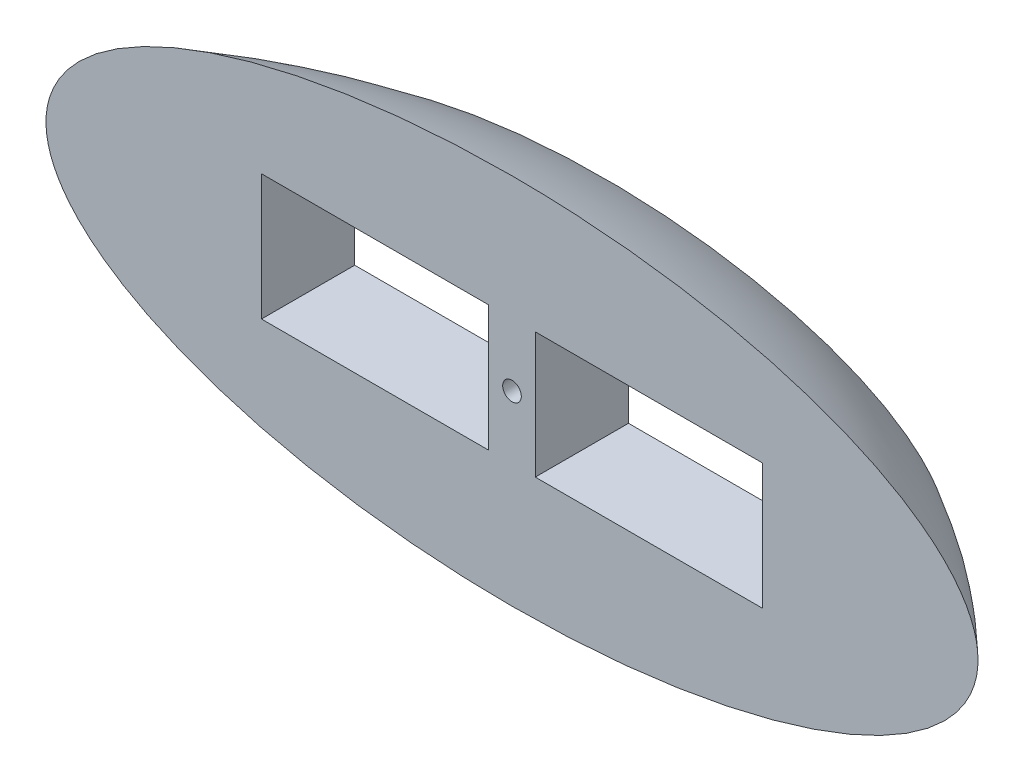
ISO-10303-21;
HEADER;
FILE_DESCRIPTION(('STEP AP214'),'2;1');
FILE_NAME('part.step','',(''),(''),'','','');
FILE_SCHEMA(('AUTOMOTIVE_DESIGN { 1 0 10303 214 1 1 1 1 }'));
ENDSEC;
DATA;
#1=APPLICATION_CONTEXT('core data for automotive mechanical design processes');
#2=APPLICATION_PROTOCOL_DEFINITION('international standard','automotive_design',2000,#1);
#3=PRODUCT_CONTEXT('',#1,'mechanical');
#4=PRODUCT('Part','Part','',(#3));
#5=PRODUCT_RELATED_PRODUCT_CATEGORY('part','',(#4));
#6=PRODUCT_DEFINITION_FORMATION('','',#4);
#7=PRODUCT_DEFINITION_CONTEXT('part definition',#1,'design');
#8=PRODUCT_DEFINITION('design','',#6,#7);
#9=PRODUCT_DEFINITION_SHAPE('','',#8);
#10=(LENGTH_UNIT() NAMED_UNIT(*) SI_UNIT(.MILLI.,.METRE.));
#11=(NAMED_UNIT(*) PLANE_ANGLE_UNIT() SI_UNIT($,.RADIAN.));
#12=(NAMED_UNIT(*) SI_UNIT($,.STERADIAN.) SOLID_ANGLE_UNIT());
#13=UNCERTAINTY_MEASURE_WITH_UNIT(LENGTH_MEASURE(1.E-05),#10,'distance_accuracy_value','');
#14=(GEOMETRIC_REPRESENTATION_CONTEXT(3) GLOBAL_UNCERTAINTY_ASSIGNED_CONTEXT((#13)) GLOBAL_UNIT_ASSIGNED_CONTEXT((#10,
#11,#12)) REPRESENTATION_CONTEXT('',''));
#15=CARTESIAN_POINT('',(0.,0.,0.));
#16=DIRECTION('',(0.,0.,1.));
#17=DIRECTION('',(1.,0.,0.));
#18=AXIS2_PLACEMENT_3D('',#15,#16,#17);
#19=CARTESIAN_POINT('',(0.,0.,50.8));
#20=DIRECTION('',(0.,0.,-1.));
#21=DIRECTION('',(-1.,0.,0.));
#22=AXIS2_PLACEMENT_3D('',#19,#20,#21);
#23=CYLINDRICAL_SURFACE('',#22,5.08);
#24=CARTESIAN_POINT('',(0.,0.,0.));
#25=DIRECTION('',(0.,0.,1.));
#26=DIRECTION('',(1.,0.,0.));
#27=AXIS2_PLACEMENT_3D('',#24,#25,#26);
#28=CIRCLE('',#27,5.08);
#29=CARTESIAN_POINT('',(5.08,0.,0.));
#30=VERTEX_POINT('',#29);
#31=EDGE_CURVE('E130',#30,#30,#28,.T.);
#32=ORIENTED_EDGE('',*,*,#31,.T.);
#33=EDGE_LOOP('',(#32));
#34=FACE_BOUND('',#33,.T.);
#35=CARTESIAN_POINT('',(0.,0.,-50.8));
#36=DIRECTION('',(0.,0.,1.));
#37=DIRECTION('',(1.,0.,0.));
#38=AXIS2_PLACEMENT_3D('',#35,#36,#37);
#39=CIRCLE('',#38,5.08);
#40=CARTESIAN_POINT('',(5.08,0.,-50.8));
#41=VERTEX_POINT('',#40);
#42=EDGE_CURVE('E47',#41,#41,#39,.T.);
#43=ORIENTED_EDGE('',*,*,#42,.F.);
#44=EDGE_LOOP('',(#43));
#45=FACE_BOUND('',#44,.T.);
#46=ADVANCED_FACE('F40',(#34,#45),#23,.F.);
#47=CARTESIAN_POINT('',(0.,0.,0.));
#48=DIRECTION('',(0.,0.,1.));
#49=DIRECTION('',(1.,0.,0.));
#50=AXIS2_PLACEMENT_3D('',#47,#48,#49);
#51=PLANE('',#50);
#52=CARTESIAN_POINT('',(0.,-101.6,0.));
#53=CARTESIAN_POINT('',(508.,-101.6,0.));
#54=CARTESIAN_POINT('',(508.,101.6,0.));
#55=CARTESIAN_POINT('',(0.,101.6,0.));
#56=CARTESIAN_POINT('',(-508.,101.6,0.));
#57=CARTESIAN_POINT('',(-508.,-101.6,0.));
#58=CARTESIAN_POINT('',(0.,-101.6,0.));
#59=(BOUNDED_CURVE() B_SPLINE_CURVE(3,(#52,#53,#54,#55,#56,#57,#58),.UNSPECIFIED.,.T.,
.F.) B_SPLINE_CURVE_WITH_KNOTS((4,3,4),(0.,0.5,1.),
.UNSPECIFIED.) CURVE() GEOMETRIC_REPRESENTATION_ITEM() RATIONAL_B_SPLINE_CURVE((1.,
0.333333333333333,0.333333333333333,1.,0.333333333333333,0.333333333333333,1.)) REPRESENTATION_ITEM(''));
#60=CARTESIAN_POINT('',(254.,0.,0.));
#61=VERTEX_POINT('',#60);
#62=CARTESIAN_POINT('',(0.,101.6,0.));
#63=VERTEX_POINT('',#62);
#64=EDGE_CURVE('E58',#61,#63,#59,.F.);
#65=ORIENTED_EDGE('',*,*,#64,.F.);
#66=CARTESIAN_POINT('',(254.,0.,0.));
#67=CARTESIAN_POINT('',(254.,203.2,0.));
#68=CARTESIAN_POINT('',(-254.,203.2,0.));
#69=CARTESIAN_POINT('',(-254.,0.,0.));
#70=CARTESIAN_POINT('',(-254.,-203.2,0.));
#71=CARTESIAN_POINT('',(254.,-203.2,0.));
#72=CARTESIAN_POINT('',(254.,0.,0.));
#73=(BOUNDED_CURVE() B_SPLINE_CURVE(3,(#66,#67,#68,#69,#70,#71,#72),.UNSPECIFIED.,.T.,
.F.) B_SPLINE_CURVE_WITH_KNOTS((4,3,4),(0.,0.5,1.),
.UNSPECIFIED.) CURVE() GEOMETRIC_REPRESENTATION_ITEM() RATIONAL_B_SPLINE_CURVE((1.,
0.333333333333333,0.333333333333333,1.,0.333333333333333,0.333333333333333,1.)) REPRESENTATION_ITEM(''));
#74=EDGE_CURVE('E117',#61,#63,#73,.T.);
#75=ORIENTED_EDGE('',*,*,#74,.T.);
#76=EDGE_LOOP('',(#65,#75));
#77=FACE_BOUND('',#76,.T.);
#78=DIRECTION('',(1.,0.,0.));
#79=VECTOR('',#78,1.);
#80=CARTESIAN_POINT('',(12.7,-34.29,0.));
#81=LINE('',#80,#79);
#82=CARTESIAN_POINT('',(12.7,-34.29,0.));
#83=VERTEX_POINT('',#82);
#84=CARTESIAN_POINT('',(136.525,-34.29,0.));
#85=VERTEX_POINT('',#84);
#86=EDGE_CURVE('E119',#83,#85,#81,.T.);
#87=ORIENTED_EDGE('',*,*,#86,.F.);
#88=DIRECTION('',(0.,-1.,0.));
#89=VECTOR('',#88,1.);
#90=CARTESIAN_POINT('',(12.7,-34.29,0.));
#91=LINE('',#90,#89);
#92=CARTESIAN_POINT('',(12.7,34.29,0.));
#93=VERTEX_POINT('',#92);
#94=EDGE_CURVE('E153',#93,#83,#91,.T.);
#95=ORIENTED_EDGE('',*,*,#94,.F.);
#96=DIRECTION('',(-1.,0.,0.));
#97=VECTOR('',#96,1.);
#98=CARTESIAN_POINT('',(12.7,34.29,0.));
#99=LINE('',#98,#97);
#100=CARTESIAN_POINT('',(136.525,34.29,0.));
#101=VERTEX_POINT('',#100);
#102=EDGE_CURVE('E156',#101,#93,#99,.T.);
#103=ORIENTED_EDGE('',*,*,#102,.F.);
#104=DIRECTION('',(0.,1.,0.));
#105=VECTOR('',#104,1.);
#106=CARTESIAN_POINT('',(136.525,34.29,0.));
#107=LINE('',#106,#105);
#108=EDGE_CURVE('E159',#85,#101,#107,.T.);
#109=ORIENTED_EDGE('',*,*,#108,.F.);
#110=EDGE_LOOP('',(#87,#95,#103,#109));
#111=FACE_BOUND('',#110,.T.);
#112=DIRECTION('',(0.,-1.,0.));
#113=VECTOR('',#112,1.);
#114=CARTESIAN_POINT('',(-136.525,34.29,0.));
#115=LINE('',#114,#113);
#116=CARTESIAN_POINT('',(-136.525,34.29,0.));
#117=VERTEX_POINT('',#116);
#118=CARTESIAN_POINT('',(-136.525,-34.29,0.));
#119=VERTEX_POINT('',#118);
#120=EDGE_CURVE('E150',#117,#119,#115,.T.);
#121=ORIENTED_EDGE('',*,*,#120,.F.);
#122=DIRECTION('',(-1.,0.,0.));
#123=VECTOR('',#122,1.);
#124=CARTESIAN_POINT('',(-136.525,34.29,0.));
#125=LINE('',#124,#123);
#126=CARTESIAN_POINT('',(-12.7,34.29,0.));
#127=VERTEX_POINT('',#126);
#128=EDGE_CURVE('E135',#127,#117,#125,.T.);
#129=ORIENTED_EDGE('',*,*,#128,.F.);
#130=DIRECTION('',(0.,1.,0.));
#131=VECTOR('',#130,1.);
#132=CARTESIAN_POINT('',(-12.7,34.29,0.));
#133=LINE('',#132,#131);
#134=CARTESIAN_POINT('',(-12.7,-34.29,0.));
#135=VERTEX_POINT('',#134);
#136=EDGE_CURVE('E139',#135,#127,#133,.T.);
#137=ORIENTED_EDGE('',*,*,#136,.F.);
#138=DIRECTION('',(1.,0.,0.));
#139=VECTOR('',#138,1.);
#140=CARTESIAN_POINT('',(-136.525,-34.29,0.));
#141=LINE('',#140,#139);
#142=EDGE_CURVE('E145',#119,#135,#141,.T.);
#143=ORIENTED_EDGE('',*,*,#142,.F.);
#144=EDGE_LOOP('',(#121,#129,#137,#143));
#145=FACE_BOUND('',#144,.T.);
#146=ORIENTED_EDGE('',*,*,#31,.F.);
#147=EDGE_LOOP('',(#146));
#148=FACE_BOUND('',#147,.T.);
#149=ADVANCED_FACE('F115',(#77,#111,#145,#148),#51,.T.);
#150=CARTESIAN_POINT('',(0.,0.,-50.8));
#151=DIRECTION('',(0.,0.,1.));
#152=DIRECTION('',(1.,0.,0.));
#153=AXIS2_PLACEMENT_3D('',#150,#151,#152);
#154=PLANE('',#153);
#155=CARTESIAN_POINT('',(0.,-74.7755753349091,-50.8));
#156=CARTESIAN_POINT('',(-2.53514302789426,-74.7755722117003,-50.8));
#157=CARTESIAN_POINT('',(-5.07025883593386,-74.7549535025683,-50.8));
#158=CARTESIAN_POINT('',(-10.1397283479047,-74.6723922981171,-50.8));
#159=CARTESIAN_POINT('',(-12.6740820789527,-74.610451506962,-50.8));
#160=CARTESIAN_POINT('',(-17.7400413260071,-74.4450537338763,-50.8));
#161=CARTESIAN_POINT('',(-20.2716475869441,-74.3416195412532,-50.8));
#162=CARTESIAN_POINT('',(-25.3327990790302,-74.0928244997233,-50.8));
#163=CARTESIAN_POINT('',(-27.8623443120151,-73.9474636882036,-50.8));
#164=CARTESIAN_POINT('',(-33.070229589654,-73.6042420937672,-50.8));
#165=CARTESIAN_POINT('',(-35.748397252446,-73.4037560381082,-50.8));
#166=CARTESIAN_POINT('',(-41.1007124985712,-72.9540963632718,-50.8));
#167=CARTESIAN_POINT('',(-43.7748599831883,-72.7049215675959,-50.8));
#168=CARTESIAN_POINT('',(-49.1180788952262,-72.1567054138531,-50.8));
#169=CARTESIAN_POINT('',(-51.7871502639425,-71.8576634825849,-50.8));
#170=CARTESIAN_POINT('',(-57.1233596460188,-71.2077299674474,-50.8));
#171=CARTESIAN_POINT('',(-59.7904875719136,-70.8567554092073,-50.8));
#172=CARTESIAN_POINT('',(-65.1171846357412,-70.1015306702302,-50.8));
#173=CARTESIAN_POINT('',(-67.7767538274598,-69.6972808695587,-50.8));
#174=CARTESIAN_POINT('',(-73.0869149440195,-68.8333473608298,-50.8));
#175=CARTESIAN_POINT('',(-75.7375067948877,-68.3736631971324,-50.8));
#176=CARTESIAN_POINT('',(-80.9846659411558,-67.4042905409775,-50.8));
#177=CARTESIAN_POINT('',(-83.5814070157674,-66.8955444101874,-50.8));
#178=CARTESIAN_POINT('',(-88.7627880441721,-65.8189733161847,-50.8));
#179=CARTESIAN_POINT('',(-91.3474273386854,-65.2511451725542,-50.8));
#180=CARTESIAN_POINT('',(-96.5025280074225,-64.0528754569345,-50.8));
#181=CARTESIAN_POINT('',(-99.0729875532142,-63.422426000538,-50.8));
#182=CARTESIAN_POINT('',(-104.197487216617,-62.0946044010077,-50.8));
#183=CARTESIAN_POINT('',(-106.751521852303,-61.3972110379612,-50.8));
#184=CARTESIAN_POINT('',(-111.831943501693,-59.9327096981796,-50.8));
#185=CARTESIAN_POINT('',(-114.358387311256,-59.1657991426449,-50.8));
#186=CARTESIAN_POINT('',(-119.386540970298,-57.5547047417876,-50.8));
#187=CARTESIAN_POINT('',(-121.888251955111,-56.7105244618697,-50.8));
#188=CARTESIAN_POINT('',(-125.617664152582,-55.3810605600232,-50.8));
#189=CARTESIAN_POINT('',(-126.856717697856,-54.9274625356581,-50.8));
#190=CARTESIAN_POINT('',(-129.326467500045,-53.9980843583448,-50.8));
#191=CARTESIAN_POINT('',(-130.557163934185,-53.5223046774794,-50.8));
#192=CARTESIAN_POINT('',(-133.008817149501,-52.5475894734828,-50.8));
#193=CARTESIAN_POINT('',(-134.229777481385,-52.0486628913675,-50.8));
#194=CARTESIAN_POINT('',(-136.661329131216,-51.0262031234981,-50.8));
#195=CARTESIAN_POINT('',(-137.871920607831,-50.5026703150763,-50.8));
#196=CARTESIAN_POINT('',(-140.891698708141,-49.1578317115569,-50.8));
#197=CARTESIAN_POINT('',(-142.693563014668,-48.319991028513,-50.8));
#198=CARTESIAN_POINT('',(-146.265895363686,-46.5796174682676,-50.8));
#199=CARTESIAN_POINT('',(-148.036364031345,-45.6770858810405,-50.8));
#200=CARTESIAN_POINT('',(-150.665117572593,-44.2688812510074,-50.8));
#201=CARTESIAN_POINT('',(-151.537754736618,-43.7898946557244,-50.8));
#202=CARTESIAN_POINT('',(-153.272391001065,-42.8130537670534,-50.8));
#203=CARTESIAN_POINT('',(-154.134390442066,-42.3152000798039,-50.8));
#204=CARTESIAN_POINT('',(-155.846609392995,-41.2995798652956,-50.8));
#205=CARTESIAN_POINT('',(-156.696828727095,-40.7818130412508,-50.8));
#206=CARTESIAN_POINT('',(-158.384078417081,-39.7252685055465,-50.8));
#207=CARTESIAN_POINT('',(-159.221109178738,-39.1864914420866,-50.8));
#208=CARTESIAN_POINT('',(-161.167840120516,-37.8962154690075,-50.8));
#209=CARTESIAN_POINT('',(-162.2715741478,-37.1356692595652,-50.8));
#210=CARTESIAN_POINT('',(-164.447861410846,-35.5709489755759,-50.8));
#211=CARTESIAN_POINT('',(-165.520412553041,-34.7667719820708,-50.8));
#212=CARTESIAN_POINT('',(-167.62903997141,-33.1108932114237,-50.8));
#213=CARTESIAN_POINT('',(-168.665100804929,-32.2591716984474,-50.8));
#214=CARTESIAN_POINT('',(-170.690054979311,-30.5073734855408,-50.8));
#215=CARTESIAN_POINT('',(-171.679085114146,-29.6074555715081,-50.8));
#216=CARTESIAN_POINT('',(-173.604345040798,-27.7531853278455,-50.8));
#217=CARTESIAN_POINT('',(-174.540591644473,-26.7988505273328,-50.8));
#218=CARTESIAN_POINT('',(-176.349084807106,-24.8323053872033,-50.8));
#219=CARTESIAN_POINT('',(-177.221381109191,-23.8201411439628,-50.8));
#220=CARTESIAN_POINT('',(-178.69224201974,-21.9804319056569,-50.8));
#221=CARTESIAN_POINT('',(-179.306821948119,-21.1656943989742,-50.8));
#222=CARTESIAN_POINT('',(-180.483920008289,-19.4993543171917,-50.8));
#223=CARTESIAN_POINT('',(-181.046443217864,-18.6477553495995,-50.8));
#224=CARTESIAN_POINT('',(-182.111253389227,-16.9076190666324,-50.8));
#225=CARTESIAN_POINT('',(-182.613544091585,-16.0190840496861,-50.8));
#226=CARTESIAN_POINT('',(-183.548932035827,-14.2059591899489,-50.8));
#227=CARTESIAN_POINT('',(-183.982027633049,-13.2813684908196,-50.8));
#228=CARTESIAN_POINT('',(-184.641511303092,-11.7048723294266,-50.8));
#229=CARTESIAN_POINT('',(-184.889359058925,-11.061892206517,-50.8));
#230=CARTESIAN_POINT('',(-185.346242908727,-9.76219270408457,-50.8));
#231=CARTESIAN_POINT('',(-185.555278169055,-9.10547302979144,-50.8));
#232=CARTESIAN_POINT('',(-185.9317756908,-7.78019180730507,-50.8));
#233=CARTESIAN_POINT('',(-186.099237999292,-7.11163027252224,-50.8));
#234=CARTESIAN_POINT('',(-186.389975351071,-5.76596336600084,-50.8));
#235=CARTESIAN_POINT('',(-186.51331543732,-5.0888721065974,-50.8));
#236=CARTESIAN_POINT('',(-186.714255483229,-3.72790255465927,-50.8));
#237=CARTESIAN_POINT('',(-186.791854171912,-3.04402407407068,-50.8));
#238=CARTESIAN_POINT('',(-186.900029126244,-1.67263617255561,-50.8));
#239=CARTESIAN_POINT('',(-186.930614649391,-0.9851274932238,-50.8));
#240=CARTESIAN_POINT('',(-186.941959295771,0.154662016143618,-50.8));
#241=CARTESIAN_POINT('',(-186.936196756156,0.606853864331761,-50.8));
#242=CARTESIAN_POINT('',(-186.904204151335,1.51055269856239,-50.8));
#243=CARTESIAN_POINT('',(-186.877973063927,1.96205964927268,-50.8));
#244=CARTESIAN_POINT('',(-186.805233007157,2.86334258616185,-50.8));
#245=CARTESIAN_POINT('',(-186.758727913797,3.31311888663487,-50.8));
#246=CARTESIAN_POINT('',(-186.645763782991,4.21020216026259,-50.8));
#247=CARTESIAN_POINT('',(-186.579302717177,4.65750887769461,-50.8));
#248=CARTESIAN_POINT('',(-186.42683865477,5.54903934148883,-50.8));
#249=CARTESIAN_POINT('',(-186.340824406124,5.99326116033519,-50.8));
#250=CARTESIAN_POINT('',(-186.149831149864,6.87765607297227,-50.8));
#251=CARTESIAN_POINT('',(-186.044849933428,7.31782868892706,-50.8));
#252=CARTESIAN_POINT('',(-185.816582199507,8.19341605138049,-50.8));
#253=CARTESIAN_POINT('',(-185.693294909989,8.62883059638233,-50.8));
#254=CARTESIAN_POINT('',(-185.429147366937,9.49430160573404,-50.8));
#255=CARTESIAN_POINT('',(-185.288286325617,9.92435782893297,-50.8));
#256=CARTESIAN_POINT('',(-184.953483689975,10.8824368951813,-50.8));
#257=CARTESIAN_POINT('',(-184.754962070557,11.4088651324062,-50.8));
#258=CARTESIAN_POINT('',(-184.3335537845,12.4518444318567,-50.8));
#259=CARTESIAN_POINT('',(-184.110665702855,12.9683949184147,-50.8));
#260=CARTESIAN_POINT('',(-183.407764051753,14.5024802757642,-50.8));
#261=CARTESIAN_POINT('',(-182.893495989455,15.5044972405794,-50.8));
#262=CARTESIAN_POINT('',(-181.785709615815,17.4651705097821,-50.8));
#263=CARTESIAN_POINT('',(-181.192073678556,18.4237595737451,-50.8));
#264=CARTESIAN_POINT('',(-179.937626379504,20.2957577840377,-50.8));
#265=CARTESIAN_POINT('',(-179.276812368925,21.2091651467702,-50.8));
#266=CARTESIAN_POINT('',(-177.836786643128,23.0710109572697,-50.8));
#267=CARTESIAN_POINT('',(-177.052271831699,24.015330693017,-50.8));
#268=CARTESIAN_POINT('',(-175.426236565115,25.8542075637764,-50.8));
#269=CARTESIAN_POINT('',(-174.584684147737,26.748736277419,-50.8));
#270=CARTESIAN_POINT('',(-172.853865346042,28.490555524772,-50.8));
#271=CARTESIAN_POINT('',(-171.964588757206,29.3378358760925,-50.8));
#272=CARTESIAN_POINT('',(-170.143863861428,30.9899001515888,-50.8));
#273=CARTESIAN_POINT('',(-169.212324486188,31.7945833391019,-50.8));
#274=CARTESIAN_POINT('',(-167.315353760104,33.3621979705949,-50.8));
#275=CARTESIAN_POINT('',(-166.349933051205,34.1251423352297,-50.8));
#276=CARTESIAN_POINT('',(-164.389890045125,35.612464259634,-50.8));
#277=CARTESIAN_POINT('',(-163.395267692973,36.3368417467974,-50.8));
#278=CARTESIAN_POINT('',(-161.611429333567,37.5880181464369,-50.8));
#279=CARTESIAN_POINT('',(-160.827295733605,38.122096138434,-50.8));
#280=CARTESIAN_POINT('',(-159.245623161501,39.1700698362902,-50.8));
#281=CARTESIAN_POINT('',(-158.448083724743,39.6839648405866,-50.8));
#282=CARTESIAN_POINT('',(-156.84058543314,40.6928694021196,-50.8));
#283=CARTESIAN_POINT('',(-156.03062035849,41.1878690378903,-50.8));
#284=CARTESIAN_POINT('',(-154.39984243725,42.159687072688,-50.8));
#285=CARTESIAN_POINT('',(-153.579029217018,42.6365048432661,-50.8));
#286=CARTESIAN_POINT('',(-151.100924527882,44.0416172034093,-50.8));
#287=CARTESIAN_POINT('',(-149.428880430559,44.9440018363079,-50.8));
#288=CARTESIAN_POINT('',(-146.052508252339,46.6860505337631,-50.8));
#289=CARTESIAN_POINT('',(-144.348178377712,47.5257111006143,-50.8));
#290=CARTESIAN_POINT('',(-140.909432540508,49.1492181007736,-50.8));
#291=CARTESIAN_POINT('',(-139.174967818574,49.9329610374188,-50.8));
#292=CARTESIAN_POINT('',(-135.684084360237,51.44724855372,-50.8));
#293=CARTESIAN_POINT('',(-133.927677249523,52.1778200121062,-50.8));
#294=CARTESIAN_POINT('',(-130.395706614648,53.590088474064,-50.8));
#295=CARTESIAN_POINT('',(-128.620146358029,54.2717936671614,-50.8));
#296=CARTESIAN_POINT('',(-125.052380563632,55.5898762650939,-50.8));
#297=CARTESIAN_POINT('',(-123.260175523355,56.2262550198036,-50.8));
#298=CARTESIAN_POINT('',(-119.401802531398,57.5454095467844,-50.8));
#299=CARTESIAN_POINT('',(-117.333398505012,58.2216414950704,-50.8));
#300=CARTESIAN_POINT('',(-113.180365250551,59.5225363726411,-50.8));
#301=CARTESIAN_POINT('',(-111.095735195784,60.1471966553587,-50.8));
#302=CARTESIAN_POINT('',(-106.912375814111,61.3482387819086,-50.8));
#303=CARTESIAN_POINT('',(-104.81364487316,61.9246149936299,-50.8));
#304=CARTESIAN_POINT('',(-100.604252589133,63.0317960104381,-50.8));
#305=CARTESIAN_POINT('',(-98.493591423949,63.5626014931261,-50.8));
#306=CARTESIAN_POINT('',(-94.2651119095285,64.5802868594073,-50.8));
#307=CARTESIAN_POINT('',(-92.1473092830678,65.0672321818262,-50.8));
#308=CARTESIAN_POINT('',(-87.9027103327612,66.0001746609194,-50.8));
#309=CARTESIAN_POINT('',(-85.7759139781493,66.4461716773977,-50.8));
#310=CARTESIAN_POINT('',(-81.5146357977869,67.2989821771661,-50.8));
#311=CARTESIAN_POINT('',(-79.3801544833024,67.7057982188896,-50.8));
#312=CARTESIAN_POINT('',(-75.1043805854361,68.4818341660025,-50.8));
#313=CARTESIAN_POINT('',(-72.9630880105754,68.851054118407,-50.8));
#314=CARTESIAN_POINT('',(-68.6789501246261,69.5525294897592,-50.8));
#315=CARTESIAN_POINT('',(-66.5361168948762,69.8848587886092,-50.8));
#316=CARTESIAN_POINT('',(-62.2453296773284,70.514574649244,-50.8));
#317=CARTESIAN_POINT('',(-60.0973756890883,70.8119612080118,-50.8));
#318=CARTESIAN_POINT('',(-55.7970423997387,71.3727921363712,-50.8));
#319=CARTESIAN_POINT('',(-53.6446630998815,71.6362365155677,-50.8));
#320=CARTESIAN_POINT('',(-49.3361027102356,72.130034098813,-50.8));
#321=CARTESIAN_POINT('',(-47.1799215669231,72.3603868331585,-50.8));
#322=CARTESIAN_POINT('',(-40.7050458919338,73.0030792350546,-50.8));
#323=CARTESIAN_POINT('',(-36.3814411829018,73.3668687580818,-50.8));
#324=CARTESIAN_POINT('',(-27.7256670095351,73.9694514597937,-50.8));
#325=CARTESIAN_POINT('',(-23.3934975840844,74.2082452046596,-50.8));
#326=CARTESIAN_POINT('',(-14.7258176980167,74.5635717349897,-50.8));
#327=CARTESIAN_POINT('',(-10.3903091645411,74.6801515318859,-50.8));
#328=CARTESIAN_POINT('',(-1.71773041689832,74.7925547628276,-50.8));
#329=CARTESIAN_POINT('',(2.61933979906599,74.7883780574663,-50.8));
#330=CARTESIAN_POINT('',(11.2893876803995,74.6592523537276,-50.8));
#331=CARTESIAN_POINT('',(15.6223662976381,74.5343670973613,-50.8));
#332=CARTESIAN_POINT('',(24.2831448706328,74.1624879306094,-50.8));
#333=CARTESIAN_POINT('',(28.6109448342021,73.9154942046873,-50.8));
#334=CARTESIAN_POINT('',(35.8161119383063,73.3996616822086,-50.8));
#335=CARTESIAN_POINT('',(38.6960067664202,73.1655591448919,-50.8));
#336=CARTESIAN_POINT('',(44.4506420243851,72.6405046310857,-50.8));
#337=CARTESIAN_POINT('',(47.3253824494777,72.3495526021417,-50.8));
#338=CARTESIAN_POINT('',(53.0683939206666,71.7091889349462,-50.8));
#339=CARTESIAN_POINT('',(55.9366648742792,71.359776466281,-50.8));
#340=CARTESIAN_POINT('',(61.6700938066379,70.5998330047513,-50.8));
#341=CARTESIAN_POINT('',(64.5352381434087,70.1891988381343,-50.8));
#342=CARTESIAN_POINT('',(70.2557595773774,69.3047744224174,-50.8));
#343=CARTESIAN_POINT('',(73.111136749607,68.8309846596033,-50.8));
#344=CARTESIAN_POINT('',(78.8101259051851,67.8172332548765,-50.8));
#345=CARTESIAN_POINT('',(81.6537380129517,67.2772723145968,-50.8));
#346=CARTESIAN_POINT('',(87.0347929665704,66.1867024668093,-50.8));
#347=CARTESIAN_POINT('',(89.5736171454789,65.6429127373753,-50.8));
#348=CARTESIAN_POINT('',(94.63797456401,64.4959399679573,-50.8));
#349=CARTESIAN_POINT('',(97.1635071702961,63.8927541242941,-50.8));
#350=CARTESIAN_POINT('',(102.19906121825,62.6231629723986,-50.8));
#351=CARTESIAN_POINT('',(104.709080376247,61.9567485820277,-50.8));
#352=CARTESIAN_POINT('',(109.711162496117,60.5560269901859,-50.8));
#353=CARTESIAN_POINT('',(112.203218313995,59.8216942275393,-50.8));
#354=CARTESIAN_POINT('',(117.157155051252,58.2823181472181,-50.8));
#355=CARTESIAN_POINT('',(119.619105025515,57.4774983536969,-50.8));
#356=CARTESIAN_POINT('',(123.29148092055,56.2110115580151,-50.8));
#357=CARTESIAN_POINT('',(124.512177054705,55.7789747561607,-50.8));
#358=CARTESIAN_POINT('',(126.946031882238,54.8941915127114,-50.8));
#359=CARTESIAN_POINT('',(128.15919072198,54.4414454746992,-50.8));
#360=CARTESIAN_POINT('',(130.576616409198,53.5144334948676,-50.8));
#361=CARTESIAN_POINT('',(131.780887132445,53.040177667051,-50.8));
#362=CARTESIAN_POINT('',(134.180156797646,52.068824633063,-50.8));
#363=CARTESIAN_POINT('',(135.375155966491,51.5717279879186,-50.8));
#364=CARTESIAN_POINT('',(137.754308574816,50.5536555493533,-50.8));
#365=CARTESIAN_POINT('',(138.938466721566,50.0326907733872,-50.8));
#366=CARTESIAN_POINT('',(141.295214990088,48.965289247239,-50.8));
#367=CARTESIAN_POINT('',(142.467805371204,48.4188530696917,-50.8));
#368=CARTESIAN_POINT('',(145.227342389769,47.0937563750205,-50.8));
#369=CARTESIAN_POINT('',(146.808688984097,46.3033677779936,-50.8));
#370=CARTESIAN_POINT('',(149.942699720833,44.6676429613496,-50.8));
#371=CARTESIAN_POINT('',(151.495364568032,43.8223080942299,-50.8));
#372=CARTESIAN_POINT('',(154.568612361554,42.0701909617149,-50.8));
#373=CARTESIAN_POINT('',(156.089149377682,41.1633276257586,-50.8));
#374=CARTESIAN_POINT('',(158.338656185288,39.753192661601,-50.8));
#375=CARTESIAN_POINT('',(159.083299758002,39.274824152056,-50.8));
#376=CARTESIAN_POINT('',(160.561043354777,38.3005952359339,-50.8));
#377=CARTESIAN_POINT('',(161.294143691827,37.8047353048114,-50.8));
#378=CARTESIAN_POINT('',(162.997322360851,36.6210267966052,-50.8));
#379=CARTESIAN_POINT('',(163.962265716413,35.925758244053,-50.8));
#380=CARTESIAN_POINT('',(165.865545678788,34.499557087219,-50.8));
#381=CARTESIAN_POINT('',(166.803881163234,33.7686229820278,-50.8));
#382=CARTESIAN_POINT('',(168.649827942258,32.2683069460586,-50.8));
#383=CARTESIAN_POINT('',(169.557430516751,31.4989142539467,-50.8));
#384=CARTESIAN_POINT('',(171.334599040451,29.9206798425543,-50.8));
#385=CARTESIAN_POINT('',(172.204236229255,29.1119186139818,-50.8));
#386=CARTESIAN_POINT('',(173.900780347978,27.4509443501568,-50.8));
#387=CARTESIAN_POINT('',(174.727696064503,26.598740322077,-50.8));
#388=CARTESIAN_POINT('',(176.330812869017,24.8484597553288,-50.8));
#389=CARTESIAN_POINT('',(177.107039888509,23.9504070977716,-50.8));
#390=CARTESIAN_POINT('',(178.503098637513,22.2252484421283,-50.8));
#391=CARTESIAN_POINT('',(179.130167222593,21.4040111213876,-50.8));
#392=CARTESIAN_POINT('',(180.331663183144,19.7238074897882,-50.8));
#393=CARTESIAN_POINT('',(180.906095307258,18.8648445927372,-50.8));
#394=CARTESIAN_POINT('',(181.993914175875,17.1090343393365,-50.8));
#395=CARTESIAN_POINT('',(182.507305982063,16.2121901326123,-50.8));
#396=CARTESIAN_POINT('',(183.463814801375,14.3814181384565,-50.8));
#397=CARTESIAN_POINT('',(183.906930329866,13.4474895681141,-50.8));
#398=CARTESIAN_POINT('',(184.582131555918,11.8541720579734,-50.8));
#399=CARTESIAN_POINT('',(184.836049002723,11.2039826884447,-50.8));
#400=CARTESIAN_POINT('',(185.304264013647,9.88939199371768,-50.8));
#401=CARTESIAN_POINT('',(185.518560659873,9.22499033966167,-50.8));
#402=CARTESIAN_POINT('',(185.904648395472,7.88391467121982,-50.8));
#403=CARTESIAN_POINT('',(186.0764394419,7.20724064443496,-50.8));
#404=CARTESIAN_POINT('',(186.37476308865,5.84507506904914,-50.8));
#405=CARTESIAN_POINT('',(186.501367293571,5.15959927013948,-50.8));
#406=CARTESIAN_POINT('',(186.707703647847,3.78159558260356,-50.8));
#407=CARTESIAN_POINT('',(186.787434585079,3.08906751207969,-50.8));
#408=CARTESIAN_POINT('',(186.898673897043,1.70023715165101,-50.8));
#409=CARTESIAN_POINT('',(186.93019258191,1.00393570065063,-50.8));
#410=CARTESIAN_POINT('',(186.942018238488,-0.145501321255814,-50.8));
#411=CARTESIAN_POINT('',(186.936377159657,-0.5985409875077,-50.8));
#412=CARTESIAN_POINT('',(186.904550319694,-1.50393785442544,-50.8));
#413=CARTESIAN_POINT('',(186.878363565192,-1.95629502103331,-50.8));
#414=CARTESIAN_POINT('',(186.805635482004,-2.85927178248083,-50.8));
#415=CARTESIAN_POINT('',(186.759098196823,-3.30989170456464,-50.8));
#416=CARTESIAN_POINT('',(186.64599456488,-4.20865460495432,-50.8));
#417=CARTESIAN_POINT('',(186.579426176229,-4.65679732599976,-50.8));
#418=CARTESIAN_POINT('',(186.426672963084,-5.549997838325,-50.8));
#419=CARTESIAN_POINT('',(186.340476400599,-5.99505361878151,-50.8));
#420=CARTESIAN_POINT('',(186.149048107037,-6.88109983648273,-50.8));
#421=CARTESIAN_POINT('',(186.043814150004,-7.32208979198523,-50.8));
#422=CARTESIAN_POINT('',(185.814974375753,-8.19929191364891,-50.8));
#423=CARTESIAN_POINT('',(185.691367759346,-8.63550387108574,-50.8));
#424=CARTESIAN_POINT('',(185.426519534894,-9.50254628628995,-50.8));
#425=CARTESIAN_POINT('',(185.285277135629,-9.93337650165364,-50.8));
#426=CARTESIAN_POINT('',(184.949844200559,-10.8923355582678,-50.8));
#427=CARTESIAN_POINT('',(184.751098508923,-11.4188768682381,-50.8));
#428=CARTESIAN_POINT('',(184.329236423887,-12.4620712960551,-50.8));
#429=CARTESIAN_POINT('',(184.106118623457,-12.9787238409859,-50.8));
#430=CARTESIAN_POINT('',(183.402522515767,-14.5130982742017,-50.8));
#431=CARTESIAN_POINT('',(182.887783754288,-15.5152869739221,-50.8));
#432=CARTESIAN_POINT('',(181.779059487241,-17.4762516695841,-50.8));
#433=CARTESIAN_POINT('',(181.184957765389,-18.4349611845697,-50.8));
#434=CARTESIAN_POINT('',(179.929581115196,-20.3071739671422,-50.8));
#435=CARTESIAN_POINT('',(179.268303513413,-21.2206754334013,-50.8));
#436=CARTESIAN_POINT('',(177.827141150346,-23.0829203242375,-50.8));
#437=CARTESIAN_POINT('',(177.04193814098,-24.0275309075283,-50.8));
#438=CARTESIAN_POINT('',(175.414510395193,-25.8669474307776,-50.8));
#439=CARTESIAN_POINT('',(174.572253679715,-26.7617249182992,-50.8));
#440=CARTESIAN_POINT('',(172.840016407376,-28.5040058881554,-50.8));
#441=CARTESIAN_POINT('',(171.950025639745,-29.3514991762083,-50.8));
#442=CARTESIAN_POINT('',(170.127849229058,-31.0039734408528,-50.8));
#443=CARTESIAN_POINT('',(169.195571805096,-31.8088528367031,-50.8));
#444=CARTESIAN_POINT('',(167.297121093361,-33.3768318411874,-50.8));
#445=CARTESIAN_POINT('',(166.330958452822,-34.1399443839858,-50.8));
#446=CARTESIAN_POINT('',(164.36942920188,-35.6275784577446,-50.8));
#447=CARTESIAN_POINT('',(163.37406253479,-36.3520999137914,-50.8));
#448=CARTESIAN_POINT('',(161.588749398496,-37.6036214443212,-50.8));
#449=CARTESIAN_POINT('',(160.803882574124,-38.1379006412428,-50.8));
#450=CARTESIAN_POINT('',(159.220738202794,-39.186257305184,-50.8));
#451=CARTESIAN_POINT('',(158.4224601908,-39.7003340696078,-50.8));
#452=CARTESIAN_POINT('',(156.813479950756,-40.7095844334396,-50.8));
#453=CARTESIAN_POINT('',(156.002771498464,-41.2047480985521,-50.8));
#454=CARTESIAN_POINT('',(154.370503363323,-42.1768776166467,-50.8));
#455=CARTESIAN_POINT('',(153.548943306682,-42.6538428405569,-50.8));
#456=CARTESIAN_POINT('',(151.06859322727,-44.0593745861921,-50.8));
#457=CARTESIAN_POINT('',(149.395046389757,-44.9620080746714,-50.8));
#458=CARTESIAN_POINT('',(146.01566251488,-46.7045002963342,-50.8));
#459=CARTESIAN_POINT('',(144.309823699435,-47.5443555601093,-50.8));
#460=CARTESIAN_POINT('',(140.868150301586,-49.168158484924,-50.8));
#461=CARTESIAN_POINT('',(139.132268484605,-49.9520058185858,-50.8));
#462=CARTESIAN_POINT('',(135.638551340165,-51.4664644850875,-50.8));
#463=CARTESIAN_POINT('',(133.880727639301,-52.1971027175536,-50.8));
#464=CARTESIAN_POINT('',(130.345923049574,-53.6094707892078,-50.8));
#465=CARTESIAN_POINT('',(128.568945411786,-54.2912087826268,-50.8));
#466=CARTESIAN_POINT('',(124.998342698196,-55.609325932917,-50.8));
#467=CARTESIAN_POINT('',(123.204718090178,-56.2457063600131,-50.8));
#468=CARTESIAN_POINT('',(119.343520335501,-57.5647574136822,-50.8));
#469=CARTESIAN_POINT('',(117.27371331758,-58.2408853588881,-50.8));
#470=CARTESIAN_POINT('',(113.117879272992,-59.5415450661841,-50.8));
#471=CARTESIAN_POINT('',(111.031851419631,-60.1660741794374,-50.8));
#472=CARTESIAN_POINT('',(106.845715502495,-61.3668234236474,-50.8));
#473=CARTESIAN_POINT('',(104.745605919385,-61.9430382481681,-50.8));
#474=CARTESIAN_POINT('',(100.533461642002,-63.0498710469219,-50.8));
#475=CARTESIAN_POINT('',(98.4214271274754,-63.5804897064891,-50.8));
#476=CARTESIAN_POINT('',(94.1898048847223,-64.597873510365,-50.8));
#477=CARTESIAN_POINT('',(92.0702309029188,-65.0846959273425,-50.8));
#478=CARTESIAN_POINT('',(87.8220892343026,-66.0173527659216,-50.8));
#479=CARTESIAN_POINT('',(85.693521510821,-66.4631870202388,-50.8));
#480=CARTESIAN_POINT('',(81.4286500837302,-67.3156432501521,-50.8));
#481=CARTESIAN_POINT('',(79.2923466972867,-67.7222668149324,-50.8));
#482=CARTESIAN_POINT('',(75.0129350743024,-68.4978765906957,-50.8));
#483=CARTESIAN_POINT('',(72.8698268625866,-68.8668629388217,-50.8));
#484=CARTESIAN_POINT('',(68.7772528745802,-69.5359219889893,-50.8));
#485=CARTESIAN_POINT('',(66.8283121230601,-69.839212294443,-50.8));
#486=CARTESIAN_POINT('',(62.9261330710265,-70.4168111022123,-50.8));
#487=CARTESIAN_POINT('',(60.972894718225,-70.6911192498959,-50.8));
#488=CARTESIAN_POINT('',(55.1072834906217,-71.4717807221298,-50.8));
#489=CARTESIAN_POINT('',(51.1892082556251,-71.9358395695877,-50.8));
#490=CARTESIAN_POINT('',(43.3416726691641,-72.7561528656141,-50.8));
#491=CARTESIAN_POINT('',(39.4122116778037,-73.1124011315895,-50.8));
#492=CARTESIAN_POINT('',(31.5442221293638,-73.7207565237273,-50.8));
#493=CARTESIAN_POINT('',(27.6056914905972,-73.9728367011993,-50.8));
#494=CARTESIAN_POINT('',(19.7237262288451,-74.3751827046158,-50.8));
#495=CARTESIAN_POINT('',(15.7802919468405,-74.5254552522424,-50.8));
#496=CARTESIAN_POINT('',(7.8912163058562,-74.7256493272303,-50.8));
#497=CARTESIAN_POINT('',(3.94557518652834,-74.7755801957217,-50.8));
#498=CARTESIAN_POINT('',(0.,-74.7755753349091,-50.8));
#499=B_SPLINE_CURVE_WITH_KNOTS('',3,(#155,#156,#157,#158,#159,#160,#161,#162,#163,#164,#165,
#166,#167,#168,#169,#170,#171,#172,#173,#174,#175,#176,#177,#178,#179,#180,#181,#182,#183,#184,
#185,#186,#187,#188,#189,#190,#191,#192,#193,#194,#195,#196,#197,#198,#199,#200,#201,#202,#203,
#204,#205,#206,#207,#208,#209,#210,#211,#212,#213,#214,#215,#216,#217,#218,#219,#220,#221,#222,
#223,#224,#225,#226,#227,#228,#229,#230,#231,#232,#233,#234,#235,#236,#237,#238,#239,#240,#241,
#242,#243,#244,#245,#246,#247,#248,#249,#250,#251,#252,#253,#254,#255,#256,#257,#258,#259,#260,
#261,#262,#263,#264,#265,#266,#267,#268,#269,#270,#271,#272,#273,#274,#275,#276,#277,#278,#279,
#280,#281,#282,#283,#284,#285,#286,#287,#288,#289,#290,#291,#292,#293,#294,#295,#296,#297,#298,
#299,#300,#301,#302,#303,#304,#305,#306,#307,#308,#309,#310,#311,#312,#313,#314,#315,#316,#317,
#318,#319,#320,#321,#322,#323,#324,#325,#326,#327,#328,#329,#330,#331,#332,#333,#334,#335,#336,
#337,#338,#339,#340,#341,#342,#343,#344,#345,#346,#347,#348,#349,#350,#351,#352,#353,#354,#355,
#356,#357,#358,#359,#360,#361,#362,#363,#364,#365,#366,#367,#368,#369,#370,#371,#372,#373,#374,
#375,#376,#377,#378,#379,#380,#381,#382,#383,#384,#385,#386,#387,#388,#389,#390,#391,#392,#393,
#394,#395,#396,#397,#398,#399,#400,#401,#402,#403,#404,#405,#406,#407,#408,#409,#410,#411,#412,
#413,#414,#415,#416,#417,#418,#419,#420,#421,#422,#423,#424,#425,#426,#427,#428,#429,#430,#431,
#432,#433,#434,#435,#436,#437,#438,#439,#440,#441,#442,#443,#444,#445,#446,#447,#448,#449,#450,
#451,#452,#453,#454,#455,#456,#457,#458,#459,#460,#461,#462,#463,#464,#465,#466,#467,#468,#469,
#470,#471,#472,#473,#474,#475,#476,#477,#478,#479,#480,#481,#482,#483,#484,#485,#486,#487,#488,
#489,#490,#491,#492,#493,#494,#495,#496,#497,#498),.UNSPECIFIED.,.T.,.F.,(4,2,2,2,2,2,2,2,2,2,2,
2,2,2,2,2,2,2,2,2,2,2,2,2,2,2,2,2,2,2,2,2,2,2,2,2,2,2,2,2,2,2,2,2,2,2,2,2,2,2,2,2,2,2,2,2,2,2,2,
2,2,2,2,2,2,2,2,2,2,2,2,2,2,2,2,2,2,2,2,2,2,2,2,2,2,2,2,2,2,2,2,2,2,2,2,2,2,2,2,2,2,2,2,2,2,2,2,
2,2,2,2,2,2,2,2,2,2,2,2,2,2,2,2,2,2,2,2,2,2,2,2,2,2,2,2,2,2,2,2,2,2,2,2,2,2,2,2,2,2,2,2,2,2,2,2,
2,2,2,2,2,2,2,2,2,2,2,2,2,2,2,2,4),(0.,7.60529779218982,15.2102819536776,22.8110949565923,
30.4119011816875,38.4684465201003,46.5251865582602,54.5820192115832,62.6518663652349,
70.7216559517464,78.7915118720295,86.729189074382,94.6672937876247,102.606399226897,
110.548029570471,118.467773790422,126.387152758997,130.345392647844,134.303548333583,
138.260187618801,142.216766249408,148.176991981478,154.13709889621,157.123259220555,
160.109323690452,163.095432682018,166.081449620124,170.101638523368,174.122096715095,
178.14423640088,182.153854988608,186.162189189872,190.167371718598,193.227274724317,
196.286878941691,199.34629305249,202.405779870041,204.471976840085,206.538218184153,
208.604457188439,210.667637562227,212.730875261142,214.793706629821,216.149970517401,
217.506302141289,218.862374574137,220.218584887838,221.575577629433,222.932728503288,
224.289936629335,225.647205617406,227.334365570315,229.021623551751,232.395986678147,
235.77540733888,239.154961299653,242.835332092911,246.517782588878,250.201023638792,
253.892618001603,257.583063053223,261.273515052239,264.119422374712,266.965428533798,
269.812909058034,272.660487915248,278.358868808258,284.057567225364,289.766553392622,
295.472633269815,301.177754615118,306.882705984115,313.410379695175,319.938388187001,
326.467157083285,332.995828885083,339.514592799267,346.033379031135,352.551739311282,
359.070091439912,365.575144512487,372.080198146719,378.585249940165,385.090394057302,
398.104982419969,411.119511831216,424.129033169097,437.138569525767,450.141239747388,
463.143890326553,471.811569652852,480.479256976802,489.147067433229,497.829653963661,
506.512173643716,515.194601268375,522.983166948279,530.77210044882,538.562154449251,
546.355152270856,554.124275142043,558.008808851211,561.893266890599,565.775917001222,
569.658471795272,573.539252123607,577.419945248295,582.722534244672,588.024992767708,
593.334578889674,595.989549852112,598.644448702248,602.21167114739,605.779043841237,
609.347420393335,612.90878486947,616.469413933017,620.028206931192,623.126230869298,
626.223975040841,629.3214621568,632.419014700509,634.511927647982,636.604889075814,
638.697852618325,640.787484698787,642.877170813849,644.96640998945,646.325211528636,
647.684078769031,649.042676134687,650.401412037041,651.760962631088,653.120672294086,
654.480441120278,655.840270973737,657.527985473204,659.215797457996,662.591262813164,
665.971726401411,669.352324576931,673.034684327233,676.719125426573,680.404357831077,
684.098012195761,687.790516178605,691.483027329136,694.331092296313,697.1792562254,
700.028896165309,702.878634520648,708.581336338988,714.284353081764,719.99734206152,
725.707422521764,731.416548588238,737.125514709486,743.657092069194,750.189004520731,
756.721633445551,763.254164164375,769.778024147069,776.301910754302,782.825532841359,
789.349131156692,795.266097585403,801.183136407034,813.017802884119,824.853147913051,
836.691552877886,848.529176155215,860.365697379008),.UNSPECIFIED.);
#500=CARTESIAN_POINT('',(0.,-74.7755753349091,-50.8));
#501=VERTEX_POINT('',#500);
#502=EDGE_CURVE('E11',#501,#501,#499,.T.);
#503=ORIENTED_EDGE('',*,*,#502,.T.);
#504=EDGE_LOOP('',(#503));
#505=FACE_BOUND('',#504,.T.);
#506=DIRECTION('',(0.,-1.,0.));
#507=VECTOR('',#506,1.);
#508=CARTESIAN_POINT('',(12.7,-34.29,-50.8));
#509=LINE('',#508,#507);
#510=CARTESIAN_POINT('',(12.7,34.29,-50.8));
#511=VERTEX_POINT('',#510);
#512=CARTESIAN_POINT('',(12.7,-34.29,-50.8));
#513=VERTEX_POINT('',#512);
#514=EDGE_CURVE('E180',#511,#513,#509,.T.);
#515=ORIENTED_EDGE('',*,*,#514,.T.);
#516=DIRECTION('',(1.,0.,0.));
#517=VECTOR('',#516,1.);
#518=CARTESIAN_POINT('',(12.7,-34.29,-50.8));
#519=LINE('',#518,#517);
#520=CARTESIAN_POINT('',(136.525,-34.29,-50.8));
#521=VERTEX_POINT('',#520);
#522=EDGE_CURVE('E187',#513,#521,#519,.T.);
#523=ORIENTED_EDGE('',*,*,#522,.T.);
#524=DIRECTION('',(0.,1.,0.));
#525=VECTOR('',#524,1.);
#526=CARTESIAN_POINT('',(136.525,34.29,-50.8));
#527=LINE('',#526,#525);
#528=CARTESIAN_POINT('',(136.525,34.29,-50.8));
#529=VERTEX_POINT('',#528);
#530=EDGE_CURVE('E66',#521,#529,#527,.T.);
#531=ORIENTED_EDGE('',*,*,#530,.T.);
#532=DIRECTION('',(-1.,0.,0.));
#533=VECTOR('',#532,1.);
#534=CARTESIAN_POINT('',(12.7,34.29,-50.8));
#535=LINE('',#534,#533);
#536=EDGE_CURVE('E183',#529,#511,#535,.T.);
#537=ORIENTED_EDGE('',*,*,#536,.T.);
#538=EDGE_LOOP('',(#515,#523,#531,#537));
#539=FACE_BOUND('',#538,.T.);
#540=DIRECTION('',(-1.,0.,0.));
#541=VECTOR('',#540,1.);
#542=CARTESIAN_POINT('',(-136.525,34.29,-50.8));
#543=LINE('',#542,#541);
#544=CARTESIAN_POINT('',(-12.7,34.29,-50.8));
#545=VERTEX_POINT('',#544);
#546=CARTESIAN_POINT('',(-136.525,34.29,-50.8));
#547=VERTEX_POINT('',#546);
#548=EDGE_CURVE('E118',#545,#547,#543,.T.);
#549=ORIENTED_EDGE('',*,*,#548,.T.);
#550=DIRECTION('',(0.,-1.,0.));
#551=VECTOR('',#550,1.);
#552=CARTESIAN_POINT('',(-136.525,34.29,-50.8));
#553=LINE('',#552,#551);
#554=CARTESIAN_POINT('',(-136.525,-34.29,-50.8));
#555=VERTEX_POINT('',#554);
#556=EDGE_CURVE('E177',#547,#555,#553,.T.);
#557=ORIENTED_EDGE('',*,*,#556,.T.);
#558=DIRECTION('',(1.,0.,0.));
#559=VECTOR('',#558,1.);
#560=CARTESIAN_POINT('',(-136.525,-34.29,-50.8));
#561=LINE('',#560,#559);
#562=CARTESIAN_POINT('',(-12.7,-34.29,-50.8));
#563=VERTEX_POINT('',#562);
#564=EDGE_CURVE('E174',#555,#563,#561,.T.);
#565=ORIENTED_EDGE('',*,*,#564,.T.);
#566=DIRECTION('',(0.,1.,0.));
#567=VECTOR('',#566,1.);
#568=CARTESIAN_POINT('',(-12.7,34.29,-50.8));
#569=LINE('',#568,#567);
#570=EDGE_CURVE('E171',#563,#545,#569,.T.);
#571=ORIENTED_EDGE('',*,*,#570,.T.);
#572=EDGE_LOOP('',(#549,#557,#565,#571));
#573=FACE_BOUND('',#572,.T.);
#574=ORIENTED_EDGE('',*,*,#42,.T.);
#575=EDGE_LOOP('',(#574));
#576=FACE_BOUND('',#575,.T.);
#577=ADVANCED_FACE('F195',(#505,#539,#573,#576),#154,.F.);
#578=CARTESIAN_POINT('',(-136.525,34.29,50.8));
#579=DIRECTION('',(0.,-1.,0.));
#580=DIRECTION('',(0.,0.,-1.));
#581=AXIS2_PLACEMENT_3D('',#578,#579,#580);
#582=PLANE('',#581);
#583=ORIENTED_EDGE('',*,*,#548,.F.);
#584=DIRECTION('',(0.,0.,-1.));
#585=VECTOR('',#584,1.);
#586=CARTESIAN_POINT('',(-12.7,34.29,50.8));
#587=LINE('',#586,#585);
#588=EDGE_CURVE('E252',#127,#545,#587,.T.);
#589=ORIENTED_EDGE('',*,*,#588,.F.);
#590=ORIENTED_EDGE('',*,*,#128,.T.);
#591=DIRECTION('',(0.,0.,-1.));
#592=VECTOR('',#591,1.);
#593=CARTESIAN_POINT('',(-136.525,34.29,50.8));
#594=LINE('',#593,#592);
#595=EDGE_CURVE('E189',#117,#547,#594,.T.);
#596=ORIENTED_EDGE('',*,*,#595,.T.);
#597=EDGE_LOOP('',(#583,#589,#590,#596));
#598=FACE_BOUND('',#597,.T.);
#599=ADVANCED_FACE('F199',(#598),#582,.T.);
#600=CARTESIAN_POINT('',(-12.7,34.29,50.8));
#601=DIRECTION('',(-1.,0.,0.));
#602=DIRECTION('',(0.,0.,1.));
#603=AXIS2_PLACEMENT_3D('',#600,#601,#602);
#604=PLANE('',#603);
#605=ORIENTED_EDGE('',*,*,#570,.F.);
#606=DIRECTION('',(0.,0.,-1.));
#607=VECTOR('',#606,1.);
#608=CARTESIAN_POINT('',(-12.7,-34.29,50.8));
#609=LINE('',#608,#607);
#610=EDGE_CURVE('E250',#135,#563,#609,.T.);
#611=ORIENTED_EDGE('',*,*,#610,.F.);
#612=ORIENTED_EDGE('',*,*,#136,.T.);
#613=ORIENTED_EDGE('',*,*,#588,.T.);
#614=EDGE_LOOP('',(#605,#611,#612,#613));
#615=FACE_BOUND('',#614,.T.);
#616=ADVANCED_FACE('F207',(#615),#604,.T.);
#617=CARTESIAN_POINT('',(-136.525,-34.29,50.8));
#618=DIRECTION('',(0.,1.,0.));
#619=DIRECTION('',(0.,0.,1.));
#620=AXIS2_PLACEMENT_3D('',#617,#618,#619);
#621=PLANE('',#620);
#622=ORIENTED_EDGE('',*,*,#564,.F.);
#623=DIRECTION('',(0.,0.,-1.));
#624=VECTOR('',#623,1.);
#625=CARTESIAN_POINT('',(-136.525,-34.29,50.8));
#626=LINE('',#625,#624);
#627=EDGE_CURVE('E245',#119,#555,#626,.T.);
#628=ORIENTED_EDGE('',*,*,#627,.F.);
#629=ORIENTED_EDGE('',*,*,#142,.T.);
#630=ORIENTED_EDGE('',*,*,#610,.T.);
#631=EDGE_LOOP('',(#622,#628,#629,#630));
#632=FACE_BOUND('',#631,.T.);
#633=ADVANCED_FACE('F210',(#632),#621,.T.);
#634=CARTESIAN_POINT('',(-136.525,34.29,50.8));
#635=DIRECTION('',(1.,0.,0.));
#636=DIRECTION('',(0.,0.,-1.));
#637=AXIS2_PLACEMENT_3D('',#634,#635,#636);
#638=PLANE('',#637);
#639=ORIENTED_EDGE('',*,*,#556,.F.);
#640=ORIENTED_EDGE('',*,*,#595,.F.);
#641=ORIENTED_EDGE('',*,*,#120,.T.);
#642=ORIENTED_EDGE('',*,*,#627,.T.);
#643=EDGE_LOOP('',(#639,#640,#641,#642));
#644=FACE_BOUND('',#643,.T.);
#645=ADVANCED_FACE('F214',(#644),#638,.T.);
#646=CARTESIAN_POINT('',(12.7,-34.29,50.8));
#647=DIRECTION('',(1.,0.,0.));
#648=DIRECTION('',(0.,1.,0.));
#649=AXIS2_PLACEMENT_3D('',#646,#647,#648);
#650=PLANE('',#649);
#651=ORIENTED_EDGE('',*,*,#514,.F.);
#652=DIRECTION('',(0.,0.,-1.));
#653=VECTOR('',#652,1.);
#654=CARTESIAN_POINT('',(12.7,34.29,50.8));
#655=LINE('',#654,#653);
#656=EDGE_CURVE('E242',#93,#511,#655,.T.);
#657=ORIENTED_EDGE('',*,*,#656,.F.);
#658=ORIENTED_EDGE('',*,*,#94,.T.);
#659=DIRECTION('',(0.,0.,-1.));
#660=VECTOR('',#659,1.);
#661=CARTESIAN_POINT('',(12.7,-34.29,50.8));
#662=LINE('',#661,#660);
#663=EDGE_CURVE('E237',#83,#513,#662,.T.);
#664=ORIENTED_EDGE('',*,*,#663,.T.);
#665=EDGE_LOOP('',(#651,#657,#658,#664));
#666=FACE_BOUND('',#665,.T.);
#667=ADVANCED_FACE('F218',(#666),#650,.T.);
#668=CARTESIAN_POINT('',(12.7,34.29,50.8));
#669=DIRECTION('',(0.,-1.,0.));
#670=DIRECTION('',(0.,0.,-1.));
#671=AXIS2_PLACEMENT_3D('',#668,#669,#670);
#672=PLANE('',#671);
#673=ORIENTED_EDGE('',*,*,#536,.F.);
#674=DIRECTION('',(0.,0.,-1.));
#675=VECTOR('',#674,1.);
#676=CARTESIAN_POINT('',(136.525,34.29,50.8));
#677=LINE('',#676,#675);
#678=EDGE_CURVE('E125',#101,#529,#677,.T.);
#679=ORIENTED_EDGE('',*,*,#678,.F.);
#680=ORIENTED_EDGE('',*,*,#102,.T.);
#681=ORIENTED_EDGE('',*,*,#656,.T.);
#682=EDGE_LOOP('',(#673,#679,#680,#681));
#683=FACE_BOUND('',#682,.T.);
#684=ADVANCED_FACE('F222',(#683),#672,.T.);
#685=CARTESIAN_POINT('',(136.525,34.29,50.8));
#686=DIRECTION('',(-1.,0.,0.));
#687=DIRECTION('',(0.,-1.,0.));
#688=AXIS2_PLACEMENT_3D('',#685,#686,#687);
#689=PLANE('',#688);
#690=ORIENTED_EDGE('',*,*,#530,.F.);
#691=DIRECTION('',(0.,0.,-1.));
#692=VECTOR('',#691,1.);
#693=CARTESIAN_POINT('',(136.525,-34.29,50.8));
#694=LINE('',#693,#692);
#695=EDGE_CURVE('E122',#85,#521,#694,.T.);
#696=ORIENTED_EDGE('',*,*,#695,.F.);
#697=ORIENTED_EDGE('',*,*,#108,.T.);
#698=ORIENTED_EDGE('',*,*,#678,.T.);
#699=EDGE_LOOP('',(#690,#696,#697,#698));
#700=FACE_BOUND('',#699,.T.);
#701=ADVANCED_FACE('F226',(#700),#689,.T.);
#702=CARTESIAN_POINT('',(12.7,-34.29,50.8));
#703=DIRECTION('',(0.,1.,0.));
#704=DIRECTION('',(-1.,0.,0.));
#705=AXIS2_PLACEMENT_3D('',#702,#703,#704);
#706=PLANE('',#705);
#707=ORIENTED_EDGE('',*,*,#522,.F.);
#708=ORIENTED_EDGE('',*,*,#663,.F.);
#709=ORIENTED_EDGE('',*,*,#86,.T.);
#710=ORIENTED_EDGE('',*,*,#695,.T.);
#711=EDGE_LOOP('',(#707,#708,#709,#710));
#712=FACE_BOUND('',#711,.T.);
#713=ADVANCED_FACE('F229',(#712),#706,.T.);
#714=CARTESIAN_POINT('',(0.,-101.6,0.));
#715=CARTESIAN_POINT('',(508.,-101.6,0.));
#716=CARTESIAN_POINT('',(508.,101.6,0.));
#717=CARTESIAN_POINT('',(0.,101.6,0.));
#718=CARTESIAN_POINT('',(-508.,101.6,0.));
#719=CARTESIAN_POINT('',(-508.,-101.6,0.));
#720=CARTESIAN_POINT('',(0.,-101.6,0.));
#721=CARTESIAN_POINT('',(0.,-74.1119242626588,-65.971381769619));
#722=CARTESIAN_POINT('',(370.559621313294,-74.1119242626588,-65.971381769619));
#723=CARTESIAN_POINT('',(370.559621313294,74.1119242626588,-65.971381769619));
#724=CARTESIAN_POINT('',(0.,74.1119242626588,-65.971381769619));
#725=CARTESIAN_POINT('',(-370.559621313294,74.1119242626588,-65.971381769619));
#726=CARTESIAN_POINT('',(-370.559621313294,-74.1119242626588,-65.971381769619));
#727=CARTESIAN_POINT('',(0.,-74.1119242626588,-65.971381769619));
#728=CARTESIAN_POINT('',(0.,-38.4833060322777,-101.6));
#729=CARTESIAN_POINT('',(192.416530161389,-38.4833060322777,-101.6));
#730=CARTESIAN_POINT('',(192.416530161389,38.4833060322777,-101.6));
#731=CARTESIAN_POINT('',(0.,38.4833060322777,-101.6));
#732=CARTESIAN_POINT('',(-192.416530161389,38.4833060322777,-101.6));
#733=CARTESIAN_POINT('',(-192.416530161389,-38.4833060322777,-101.6));
#734=CARTESIAN_POINT('',(0.,-38.4833060322777,-101.6));
#735=CARTESIAN_POINT('',(0.,0.,-101.6));
#736=CARTESIAN_POINT('',(0.,0.,-101.6));
#737=CARTESIAN_POINT('',(0.,0.,-101.6));
#738=CARTESIAN_POINT('',(0.,0.,-101.6));
#739=CARTESIAN_POINT('',(0.,0.,-101.6));
#740=CARTESIAN_POINT('',(0.,0.,-101.6));
#741=CARTESIAN_POINT('',(0.,0.,-101.6));
#742=(BOUNDED_SURFACE() B_SPLINE_SURFACE(3,3,((#714,#715,#716,#717,#718,#719,#720),(#721,#722,
#723,#724,#725,#726,#727),(#728,#729,#730,#731,#732,#733,#734),(#735,#736,#737,#738,#739,#740,
#741)),.UNSPECIFIED.,.F.,.T.,.F.) B_SPLINE_SURFACE_WITH_KNOTS((4,4),(4,3,4),(0.,1.),(0.,0.5,1.),
.UNSPECIFIED.) GEOMETRIC_REPRESENTATION_ITEM() RATIONAL_B_SPLINE_SURFACE(((1.,0.333333333333333,
0.333333333333333,1.,0.333333333333333,0.333333333333333,1.),(0.950546733181701,
0.316848911060567,0.316848911060567,0.950546733181701,0.316848911060567,0.316848911060567,
0.950546733181701),(0.950546733181701,0.316848911060567,0.316848911060567,0.950546733181701,
0.316848911060567,0.316848911060567,0.950546733181701),(1.,0.333333333333333,0.333333333333333,
1.,0.333333333333333,0.333333333333333,1.))) REPRESENTATION_ITEM('') SURFACE());
#743=ORIENTED_EDGE('',*,*,#74,.F.);
#744=ORIENTED_EDGE('',*,*,#64,.T.);
#745=EDGE_LOOP('',(#743,#744));
#746=FACE_BOUND('',#745,.T.);
#747=ORIENTED_EDGE('',*,*,#502,.F.);
#748=EDGE_LOOP('',(#747));
#749=FACE_BOUND('',#748,.T.);
#750=ADVANCED_FACE('F42',(#746,#749),#742,.T.);
#751=CLOSED_SHELL('',(#46,#149,#577,#599,#616,#633,#645,#667,#684,#701,#713,#750));
#752=MANIFOLD_SOLID_BREP('B2',#751);
#753=ADVANCED_BREP_SHAPE_REPRESENTATION('',(#18,#752),#14);
#754=SHAPE_DEFINITION_REPRESENTATION(#9,#753);
ENDSEC;
END-ISO-10303-21;
